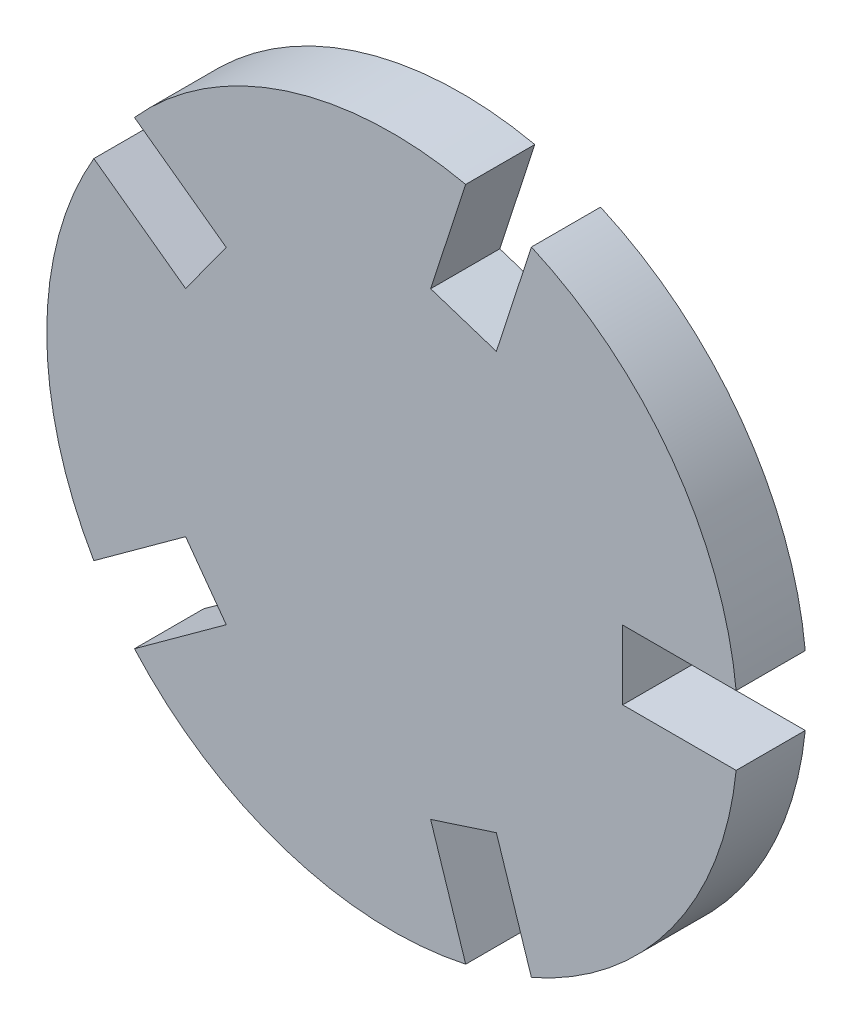
ISO-10303-21;
HEADER;
FILE_DESCRIPTION(('STEP AP214'),'2;1');
FILE_NAME('part.step','',(''),(''),'','','');
FILE_SCHEMA(('AUTOMOTIVE_DESIGN { 1 0 10303 214 1 1 1 1 }'));
ENDSEC;
DATA;
#1=APPLICATION_CONTEXT('core data for automotive mechanical design processes');
#2=APPLICATION_PROTOCOL_DEFINITION('international standard','automotive_design',2000,#1);
#3=PRODUCT_CONTEXT('',#1,'mechanical');
#4=PRODUCT('Part','Part','',(#3));
#5=PRODUCT_RELATED_PRODUCT_CATEGORY('part','',(#4));
#6=PRODUCT_DEFINITION_FORMATION('','',#4);
#7=PRODUCT_DEFINITION_CONTEXT('part definition',#1,'design');
#8=PRODUCT_DEFINITION('design','',#6,#7);
#9=PRODUCT_DEFINITION_SHAPE('','',#8);
#10=(LENGTH_UNIT() NAMED_UNIT(*) SI_UNIT(.MILLI.,.METRE.));
#11=(NAMED_UNIT(*) PLANE_ANGLE_UNIT() SI_UNIT($,.RADIAN.));
#12=(NAMED_UNIT(*) SI_UNIT($,.STERADIAN.) SOLID_ANGLE_UNIT());
#13=UNCERTAINTY_MEASURE_WITH_UNIT(LENGTH_MEASURE(1.E-05),#10,'distance_accuracy_value','');
#14=(GEOMETRIC_REPRESENTATION_CONTEXT(3) GLOBAL_UNCERTAINTY_ASSIGNED_CONTEXT((#13)) GLOBAL_UNIT_ASSIGNED_CONTEXT((#10,
#11,#12)) REPRESENTATION_CONTEXT('',''));
#15=CARTESIAN_POINT('',(0.,0.,0.));
#16=DIRECTION('',(0.,0.,1.));
#17=DIRECTION('',(1.,0.,0.));
#18=AXIS2_PLACEMENT_3D('',#15,#16,#17);
#19=CARTESIAN_POINT('',(0.,1.5,3.));
#20=DIRECTION('',(0.,1.,0.));
#21=DIRECTION('',(0.,0.,1.));
#22=AXIS2_PLACEMENT_3D('',#19,#20,#21);
#23=PLANE('',#22);
#24=DIRECTION('',(1.,0.,0.));
#25=VECTOR('',#24,1.);
#26=CARTESIAN_POINT('',(0.,1.5,0.));
#27=LINE('',#26,#25);
#28=CARTESIAN_POINT('',(10.,1.5,0.));
#29=VERTEX_POINT('',#28);
#30=CARTESIAN_POINT('',(14.9248115565993,1.5,0.));
#31=VERTEX_POINT('',#30);
#32=EDGE_CURVE('E208',#29,#31,#27,.T.);
#33=ORIENTED_EDGE('',*,*,#32,.T.);
#34=DIRECTION('',(0.,0.,-1.));
#35=VECTOR('',#34,1.);
#36=CARTESIAN_POINT('',(14.9248115565993,1.5,3.));
#37=LINE('',#36,#35);
#38=CARTESIAN_POINT('',(14.9248115565993,1.5,3.));
#39=VERTEX_POINT('',#38);
#40=EDGE_CURVE('E11',#39,#31,#37,.T.);
#41=ORIENTED_EDGE('',*,*,#40,.F.);
#42=DIRECTION('',(1.,0.,0.));
#43=VECTOR('',#42,1.);
#44=CARTESIAN_POINT('',(0.,1.5,3.));
#45=LINE('',#44,#43);
#46=CARTESIAN_POINT('',(10.,1.5,3.));
#47=VERTEX_POINT('',#46);
#48=EDGE_CURVE('E248',#47,#39,#45,.T.);
#49=ORIENTED_EDGE('',*,*,#48,.F.);
#50=DIRECTION('',(0.,0.,-1.));
#51=VECTOR('',#50,1.);
#52=CARTESIAN_POINT('',(10.,1.5,3.));
#53=LINE('',#52,#51);
#54=EDGE_CURVE('E203',#47,#29,#53,.T.);
#55=ORIENTED_EDGE('',*,*,#54,.T.);
#56=EDGE_LOOP('',(#33,#41,#49,#55));
#57=FACE_BOUND('',#56,.T.);
#58=ADVANCED_FACE('F39',(#57),#23,.F.);
#59=CARTESIAN_POINT('',(0.,0.,3.));
#60=DIRECTION('',(0.,0.,-1.));
#61=DIRECTION('',(-1.,0.,0.));
#62=AXIS2_PLACEMENT_3D('',#59,#60,#61);
#63=CYLINDRICAL_SURFACE('',#62,15.);
#64=CARTESIAN_POINT('',(0.,0.,0.));
#65=DIRECTION('',(0.,0.,1.));
#66=DIRECTION('',(1.,0.,0.));
#67=AXIS2_PLACEMENT_3D('',#64,#65,#66);
#68=CIRCLE('',#67,15.);
#69=CARTESIAN_POINT('',(6.03860518327568,13.7308137938185,0.));
#70=VERTEX_POINT('',#69);
#71=EDGE_CURVE('E211',#31,#70,#68,.T.);
#72=ORIENTED_EDGE('',*,*,#71,.T.);
#73=DIRECTION('',(0.,0.,-1.));
#74=VECTOR('',#73,1.);
#75=CARTESIAN_POINT('',(6.03860518327568,13.7308137938185,3.));
#76=LINE('',#75,#74);
#77=CARTESIAN_POINT('',(6.03860518327568,13.7308137938185,3.));
#78=VERTEX_POINT('',#77);
#79=EDGE_CURVE('E47',#78,#70,#76,.T.);
#80=ORIENTED_EDGE('',*,*,#79,.F.);
#81=CARTESIAN_POINT('',(0.,0.,3.));
#82=DIRECTION('',(0.,0.,1.));
#83=DIRECTION('',(1.,0.,0.));
#84=AXIS2_PLACEMENT_3D('',#81,#82,#83);
#85=CIRCLE('',#84,15.);
#86=EDGE_CURVE('E130',#39,#78,#85,.T.);
#87=ORIENTED_EDGE('',*,*,#86,.F.);
#88=ORIENTED_EDGE('',*,*,#40,.T.);
#89=EDGE_LOOP('',(#72,#80,#87,#88));
#90=FACE_BOUND('',#89,.T.);
#91=ADVANCED_FACE('F292',(#90),#63,.T.);
#92=CARTESIAN_POINT('',(1.42658477444273,-0.463525491562438,3.));
#93=DIRECTION('',(-0.95105651629515,0.309016994374958,0.));
#94=DIRECTION('',(-0.309016994374958,-0.95105651629515,0.));
#95=AXIS2_PLACEMENT_3D('',#92,#93,#94);
#96=PLANE('',#95);
#97=DIRECTION('',(0.309016994374958,0.95105651629515,0.));
#98=VECTOR('',#97,1.);
#99=CARTESIAN_POINT('',(1.42658477444273,-0.463525491562438,0.));
#100=LINE('',#99,#98);
#101=CARTESIAN_POINT('',(4.51675471819231,9.04703967138906,0.));
#102=VERTEX_POINT('',#101);
#103=EDGE_CURVE('E214',#102,#70,#100,.T.);
#104=ORIENTED_EDGE('',*,*,#103,.F.);
#105=DIRECTION('',(0.,0.,-1.));
#106=VECTOR('',#105,1.);
#107=CARTESIAN_POINT('',(4.51675471819231,9.04703967138906,3.));
#108=LINE('',#107,#106);
#109=CARTESIAN_POINT('',(4.51675471819231,9.04703967138906,3.));
#110=VERTEX_POINT('',#109);
#111=EDGE_CURVE('E285',#110,#102,#108,.T.);
#112=ORIENTED_EDGE('',*,*,#111,.F.);
#113=DIRECTION('',(0.309016994374958,0.95105651629515,0.));
#114=VECTOR('',#113,1.);
#115=CARTESIAN_POINT('',(1.42658477444273,-0.463525491562438,3.));
#116=LINE('',#115,#114);
#117=EDGE_CURVE('E291',#110,#78,#116,.T.);
#118=ORIENTED_EDGE('',*,*,#117,.T.);
#119=ORIENTED_EDGE('',*,*,#79,.T.);
#120=EDGE_LOOP('',(#104,#112,#118,#119));
#121=FACE_BOUND('',#120,.T.);
#122=ADVANCED_FACE('F289',(#121),#96,.T.);
#123=CARTESIAN_POINT('',(3.09016994374959,9.5105651629515,3.));
#124=DIRECTION('',(-0.309016994374958,-0.95105651629515,0.));
#125=DIRECTION('',(0.95105651629515,-0.309016994374958,0.));
#126=AXIS2_PLACEMENT_3D('',#123,#124,#125);
#127=PLANE('',#126);
#128=DIRECTION('',(-0.95105651629515,0.309016994374958,0.));
#129=VECTOR('',#128,1.);
#130=CARTESIAN_POINT('',(3.09016994374959,9.5105651629515,0.));
#131=LINE('',#130,#129);
#132=CARTESIAN_POINT('',(1.66358516930686,9.97409065451394,0.));
#133=VERTEX_POINT('',#132);
#134=EDGE_CURVE('E218',#102,#133,#131,.T.);
#135=ORIENTED_EDGE('',*,*,#134,.T.);
#136=DIRECTION('',(0.,0.,-1.));
#137=VECTOR('',#136,1.);
#138=CARTESIAN_POINT('',(1.66358516930686,9.97409065451394,3.));
#139=LINE('',#138,#137);
#140=CARTESIAN_POINT('',(1.66358516930686,9.97409065451394,3.));
#141=VERTEX_POINT('',#140);
#142=EDGE_CURVE('E282',#141,#133,#139,.T.);
#143=ORIENTED_EDGE('',*,*,#142,.F.);
#144=DIRECTION('',(-0.95105651629515,0.309016994374958,0.));
#145=VECTOR('',#144,1.);
#146=CARTESIAN_POINT('',(3.09016994374959,9.5105651629515,3.));
#147=LINE('',#146,#145);
#148=EDGE_CURVE('E311',#110,#141,#147,.T.);
#149=ORIENTED_EDGE('',*,*,#148,.F.);
#150=ORIENTED_EDGE('',*,*,#111,.T.);
#151=EDGE_LOOP('',(#135,#143,#149,#150));
#152=FACE_BOUND('',#151,.T.);
#153=ADVANCED_FACE('F302',(#152),#127,.F.);
#154=CARTESIAN_POINT('',(-1.42658477444272,0.463525491562437,3.));
#155=DIRECTION('',(-0.95105651629515,0.309016994374958,0.));
#156=DIRECTION('',(-0.309016994374958,-0.95105651629515,0.));
#157=AXIS2_PLACEMENT_3D('',#154,#155,#156);
#158=PLANE('',#157);
#159=DIRECTION('',(0.309016994374958,0.95105651629515,0.));
#160=VECTOR('',#159,1.);
#161=CARTESIAN_POINT('',(-1.42658477444272,0.463525491562437,0.));
#162=LINE('',#161,#160);
#163=CARTESIAN_POINT('',(3.18543563439023,14.6578647769434,0.));
#164=VERTEX_POINT('',#163);
#165=EDGE_CURVE('E220',#133,#164,#162,.T.);
#166=ORIENTED_EDGE('',*,*,#165,.T.);
#167=DIRECTION('',(0.,0.,-1.));
#168=VECTOR('',#167,1.);
#169=CARTESIAN_POINT('',(3.18543563439023,14.6578647769434,3.));
#170=LINE('',#169,#168);
#171=CARTESIAN_POINT('',(3.18543563439023,14.6578647769434,3.));
#172=VERTEX_POINT('',#171);
#173=EDGE_CURVE('E279',#172,#164,#170,.T.);
#174=ORIENTED_EDGE('',*,*,#173,.F.);
#175=DIRECTION('',(0.309016994374958,0.95105651629515,0.));
#176=VECTOR('',#175,1.);
#177=CARTESIAN_POINT('',(-1.42658477444272,0.463525491562437,3.));
#178=LINE('',#177,#176);
#179=EDGE_CURVE('E308',#141,#172,#178,.T.);
#180=ORIENTED_EDGE('',*,*,#179,.F.);
#181=ORIENTED_EDGE('',*,*,#142,.T.);
#182=EDGE_LOOP('',(#166,#174,#180,#181));
#183=FACE_BOUND('',#182,.T.);
#184=ADVANCED_FACE('F306',(#183),#158,.F.);
#185=CARTESIAN_POINT('',(-11.1927483086936,9.98610961777586,0.));
#186=VERTEX_POINT('',#185);
#187=EDGE_CURVE('E215',#164,#186,#68,.T.);
#188=ORIENTED_EDGE('',*,*,#187,.T.);
#189=DIRECTION('',(0.,0.,-1.));
#190=VECTOR('',#189,1.);
#191=CARTESIAN_POINT('',(-11.1927483086936,9.98610961777586,3.));
#192=LINE('',#191,#190);
#193=CARTESIAN_POINT('',(-11.1927483086936,9.98610961777586,3.));
#194=VERTEX_POINT('',#193);
#195=EDGE_CURVE('E277',#194,#186,#192,.T.);
#196=ORIENTED_EDGE('',*,*,#195,.F.);
#197=EDGE_CURVE('E310',#172,#194,#85,.T.);
#198=ORIENTED_EDGE('',*,*,#197,.F.);
#199=ORIENTED_EDGE('',*,*,#173,.T.);
#200=EDGE_LOOP('',(#188,#196,#198,#199));
#201=FACE_BOUND('',#200,.T.);
#202=ADVANCED_FACE('F354',(#201),#63,.T.);
#203=CARTESIAN_POINT('',(0.88167787843872,1.21352549156241,3.));
#204=DIRECTION('',(-0.58778525229248,-0.809016994374942,0.));
#205=DIRECTION('',(0.809016994374942,-0.58778525229248,0.));
#206=AXIS2_PLACEMENT_3D('',#203,#204,#205);
#207=PLANE('',#206);
#208=DIRECTION('',(-0.809016994374942,0.58778525229248,0.));
#209=VECTOR('',#208,1.);
#210=CARTESIAN_POINT('',(0.88167787843872,1.21352549156241,0.));
#211=LINE('',#210,#209);
#212=CARTESIAN_POINT('',(-7.2084920653107,7.09137801448722,0.));
#213=VERTEX_POINT('',#212);
#214=EDGE_CURVE('E222',#213,#186,#211,.T.);
#215=ORIENTED_EDGE('',*,*,#214,.F.);
#216=DIRECTION('',(0.,0.,-1.));
#217=VECTOR('',#216,1.);
#218=CARTESIAN_POINT('',(-7.2084920653107,7.09137801448722,3.));
#219=LINE('',#218,#217);
#220=CARTESIAN_POINT('',(-7.2084920653107,7.09137801448722,3.));
#221=VERTEX_POINT('',#220);
#222=EDGE_CURVE('E275',#221,#213,#219,.T.);
#223=ORIENTED_EDGE('',*,*,#222,.F.);
#224=DIRECTION('',(-0.809016994374942,0.58778525229248,0.));
#225=VECTOR('',#224,1.);
#226=CARTESIAN_POINT('',(0.88167787843872,1.21352549156241,3.));
#227=LINE('',#226,#225);
#228=EDGE_CURVE('E313',#221,#194,#227,.T.);
#229=ORIENTED_EDGE('',*,*,#228,.T.);
#230=ORIENTED_EDGE('',*,*,#195,.T.);
#231=EDGE_LOOP('',(#215,#223,#229,#230));
#232=FACE_BOUND('',#231,.T.);
#233=ADVANCED_FACE('F359',(#232),#207,.T.);
#234=CARTESIAN_POINT('',(-8.09016994374942,5.8778525229248,3.));
#235=DIRECTION('',(0.809016994374942,-0.58778525229248,0.));
#236=DIRECTION('',(0.58778525229248,0.809016994374942,0.));
#237=AXIS2_PLACEMENT_3D('',#234,#235,#236);
#238=PLANE('',#237);
#239=DIRECTION('',(-0.58778525229248,-0.809016994374942,0.));
#240=VECTOR('',#239,1.);
#241=CARTESIAN_POINT('',(-8.09016994374942,5.8778525229248,0.));
#242=LINE('',#241,#240);
#243=CARTESIAN_POINT('',(-8.97184782218814,4.66432703136239,0.));
#244=VERTEX_POINT('',#243);
#245=EDGE_CURVE('E225',#213,#244,#242,.T.);
#246=ORIENTED_EDGE('',*,*,#245,.T.);
#247=DIRECTION('',(0.,0.,-1.));
#248=VECTOR('',#247,1.);
#249=CARTESIAN_POINT('',(-8.97184782218814,4.66432703136239,3.));
#250=LINE('',#249,#248);
#251=CARTESIAN_POINT('',(-8.97184782218814,4.66432703136239,3.));
#252=VERTEX_POINT('',#251);
#253=EDGE_CURVE('E272',#252,#244,#250,.T.);
#254=ORIENTED_EDGE('',*,*,#253,.F.);
#255=DIRECTION('',(-0.58778525229248,-0.809016994374942,0.));
#256=VECTOR('',#255,1.);
#257=CARTESIAN_POINT('',(-8.09016994374942,5.8778525229248,3.));
#258=LINE('',#257,#256);
#259=EDGE_CURVE('E320',#221,#252,#258,.T.);
#260=ORIENTED_EDGE('',*,*,#259,.F.);
#261=ORIENTED_EDGE('',*,*,#222,.T.);
#262=EDGE_LOOP('',(#246,#254,#260,#261));
#263=FACE_BOUND('',#262,.T.);
#264=ADVANCED_FACE('F366',(#263),#238,.F.);
#265=CARTESIAN_POINT('',(-0.881677878438719,-1.21352549156241,3.));
#266=DIRECTION('',(-0.58778525229248,-0.809016994374942,0.));
#267=DIRECTION('',(0.809016994374942,-0.58778525229248,0.));
#268=AXIS2_PLACEMENT_3D('',#265,#266,#267);
#269=PLANE('',#268);
#270=DIRECTION('',(-0.809016994374942,0.58778525229248,0.));
#271=VECTOR('',#270,1.);
#272=CARTESIAN_POINT('',(-0.881677878438719,-1.21352549156241,0.));
#273=LINE('',#272,#271);
#274=CARTESIAN_POINT('',(-12.9561040655711,7.55905863465103,0.));
#275=VERTEX_POINT('',#274);
#276=EDGE_CURVE('E227',#244,#275,#273,.T.);
#277=ORIENTED_EDGE('',*,*,#276,.T.);
#278=DIRECTION('',(0.,0.,-1.));
#279=VECTOR('',#278,1.);
#280=CARTESIAN_POINT('',(-12.9561040655711,7.55905863465103,3.));
#281=LINE('',#280,#279);
#282=CARTESIAN_POINT('',(-12.9561040655711,7.55905863465103,3.));
#283=VERTEX_POINT('',#282);
#284=EDGE_CURVE('E269',#283,#275,#281,.T.);
#285=ORIENTED_EDGE('',*,*,#284,.F.);
#286=DIRECTION('',(-0.809016994374942,0.58778525229248,0.));
#287=VECTOR('',#286,1.);
#288=CARTESIAN_POINT('',(-0.881677878438719,-1.21352549156241,3.));
#289=LINE('',#288,#287);
#290=EDGE_CURVE('E322',#252,#283,#289,.T.);
#291=ORIENTED_EDGE('',*,*,#290,.F.);
#292=ORIENTED_EDGE('',*,*,#253,.T.);
#293=EDGE_LOOP('',(#277,#285,#291,#292));
#294=FACE_BOUND('',#293,.T.);
#295=ADVANCED_FACE('F368',(#294),#269,.F.);
#296=CARTESIAN_POINT('',(-12.9561040655712,-7.55905863465084,0.));
#297=VERTEX_POINT('',#296);
#298=EDGE_CURVE('E229',#275,#297,#68,.T.);
#299=ORIENTED_EDGE('',*,*,#298,.T.);
#300=DIRECTION('',(0.,0.,-1.));
#301=VECTOR('',#300,1.);
#302=CARTESIAN_POINT('',(-12.9561040655712,-7.55905863465084,3.));
#303=LINE('',#302,#301);
#304=CARTESIAN_POINT('',(-12.9561040655712,-7.55905863465084,3.));
#305=VERTEX_POINT('',#304);
#306=EDGE_CURVE('E267',#305,#297,#303,.T.);
#307=ORIENTED_EDGE('',*,*,#306,.F.);
#308=EDGE_CURVE('E314',#283,#305,#85,.T.);
#309=ORIENTED_EDGE('',*,*,#308,.F.);
#310=ORIENTED_EDGE('',*,*,#284,.T.);
#311=EDGE_LOOP('',(#299,#307,#309,#310));
#312=FACE_BOUND('',#311,.T.);
#313=ADVANCED_FACE('F370',(#312),#63,.T.);
#314=CARTESIAN_POINT('',(-0.881677878438703,1.21352549156243,3.));
#315=DIRECTION('',(0.587785252292468,-0.809016994374951,0.));
#316=DIRECTION('',(0.809016994374951,0.587785252292468,0.));
#317=AXIS2_PLACEMENT_3D('',#314,#315,#316);
#318=PLANE('',#317);
#319=DIRECTION('',(-0.809016994374951,-0.587785252292468,0.));
#320=VECTOR('',#319,1.);
#321=CARTESIAN_POINT('',(-0.881677878438703,1.21352549156243,0.));
#322=LINE('',#321,#320);
#323=CARTESIAN_POINT('',(-8.97184782218821,-4.66432703136226,0.));
#324=VERTEX_POINT('',#323);
#325=EDGE_CURVE('E230',#324,#297,#322,.T.);
#326=ORIENTED_EDGE('',*,*,#325,.F.);
#327=DIRECTION('',(0.,0.,-1.));
#328=VECTOR('',#327,1.);
#329=CARTESIAN_POINT('',(-8.97184782218821,-4.66432703136226,3.));
#330=LINE('',#329,#328);
#331=CARTESIAN_POINT('',(-8.97184782218821,-4.66432703136226,3.));
#332=VERTEX_POINT('',#331);
#333=EDGE_CURVE('E265',#332,#324,#330,.T.);
#334=ORIENTED_EDGE('',*,*,#333,.F.);
#335=DIRECTION('',(-0.809016994374951,-0.587785252292468,0.));
#336=VECTOR('',#335,1.);
#337=CARTESIAN_POINT('',(-0.881677878438703,1.21352549156243,3.));
#338=LINE('',#337,#336);
#339=EDGE_CURVE('E324',#332,#305,#338,.T.);
#340=ORIENTED_EDGE('',*,*,#339,.T.);
#341=ORIENTED_EDGE('',*,*,#306,.T.);
#342=EDGE_LOOP('',(#326,#334,#340,#341));
#343=FACE_BOUND('',#342,.T.);
#344=ADVANCED_FACE('F390',(#343),#318,.T.);
#345=CARTESIAN_POINT('',(-8.09016994374951,-5.87785252292469,3.));
#346=DIRECTION('',(0.809016994374951,0.587785252292468,0.));
#347=DIRECTION('',(-0.587785252292469,0.809016994374951,0.));
#348=AXIS2_PLACEMENT_3D('',#345,#346,#347);
#349=PLANE('',#348);
#350=DIRECTION('',(0.587785252292469,-0.809016994374951,0.));
#351=VECTOR('',#350,1.);
#352=CARTESIAN_POINT('',(-8.09016994374951,-5.87785252292469,0.));
#353=LINE('',#352,#351);
#354=CARTESIAN_POINT('',(-7.2084920653108,-7.09137801448711,0.));
#355=VERTEX_POINT('',#354);
#356=EDGE_CURVE('E233',#324,#355,#353,.T.);
#357=ORIENTED_EDGE('',*,*,#356,.T.);
#358=DIRECTION('',(0.,0.,-1.));
#359=VECTOR('',#358,1.);
#360=CARTESIAN_POINT('',(-7.2084920653108,-7.09137801448711,3.));
#361=LINE('',#360,#359);
#362=CARTESIAN_POINT('',(-7.2084920653108,-7.09137801448711,3.));
#363=VERTEX_POINT('',#362);
#364=EDGE_CURVE('E262',#363,#355,#361,.T.);
#365=ORIENTED_EDGE('',*,*,#364,.F.);
#366=DIRECTION('',(0.587785252292469,-0.809016994374951,0.));
#367=VECTOR('',#366,1.);
#368=CARTESIAN_POINT('',(-8.09016994374951,-5.87785252292469,3.));
#369=LINE('',#368,#367);
#370=EDGE_CURVE('E327',#332,#363,#369,.T.);
#371=ORIENTED_EDGE('',*,*,#370,.F.);
#372=ORIENTED_EDGE('',*,*,#333,.T.);
#373=EDGE_LOOP('',(#357,#365,#371,#372));
#374=FACE_BOUND('',#373,.T.);
#375=ADVANCED_FACE('F388',(#374),#349,.F.);
#376=CARTESIAN_POINT('',(0.881677878438702,-1.21352549156242,3.));
#377=DIRECTION('',(0.587785252292468,-0.809016994374951,0.));
#378=DIRECTION('',(0.809016994374951,0.587785252292468,0.));
#379=AXIS2_PLACEMENT_3D('',#376,#377,#378);
#380=PLANE('',#379);
#381=DIRECTION('',(-0.809016994374951,-0.587785252292469,0.));
#382=VECTOR('',#381,1.);
#383=CARTESIAN_POINT('',(0.881677878438702,-1.21352549156242,0.));
#384=LINE('',#383,#382);
#385=CARTESIAN_POINT('',(-11.1927483086938,-9.98610961777569,0.));
#386=VERTEX_POINT('',#385);
#387=EDGE_CURVE('E235',#355,#386,#384,.T.);
#388=ORIENTED_EDGE('',*,*,#387,.T.);
#389=DIRECTION('',(0.,0.,-1.));
#390=VECTOR('',#389,1.);
#391=CARTESIAN_POINT('',(-11.1927483086938,-9.98610961777569,3.));
#392=LINE('',#391,#390);
#393=CARTESIAN_POINT('',(-11.1927483086938,-9.98610961777569,3.));
#394=VERTEX_POINT('',#393);
#395=EDGE_CURVE('E259',#394,#386,#392,.T.);
#396=ORIENTED_EDGE('',*,*,#395,.F.);
#397=DIRECTION('',(-0.809016994374951,-0.587785252292469,0.));
#398=VECTOR('',#397,1.);
#399=CARTESIAN_POINT('',(0.881677878438702,-1.21352549156242,3.));
#400=LINE('',#399,#398);
#401=EDGE_CURVE('E329',#363,#394,#400,.T.);
#402=ORIENTED_EDGE('',*,*,#401,.F.);
#403=ORIENTED_EDGE('',*,*,#364,.T.);
#404=EDGE_LOOP('',(#388,#396,#402,#403));
#405=FACE_BOUND('',#404,.T.);
#406=ADVANCED_FACE('F384',(#405),#380,.F.);
#407=CARTESIAN_POINT('',(3.18543563439002,-14.6578647769434,0.));
#408=VERTEX_POINT('',#407);
#409=EDGE_CURVE('E237',#386,#408,#68,.T.);
#410=ORIENTED_EDGE('',*,*,#409,.T.);
#411=DIRECTION('',(0.,0.,-1.));
#412=VECTOR('',#411,1.);
#413=CARTESIAN_POINT('',(3.18543563439002,-14.6578647769434,3.));
#414=LINE('',#413,#412);
#415=CARTESIAN_POINT('',(3.18543563439002,-14.6578647769434,3.));
#416=VERTEX_POINT('',#415);
#417=EDGE_CURVE('E257',#416,#408,#414,.T.);
#418=ORIENTED_EDGE('',*,*,#417,.F.);
#419=EDGE_CURVE('E190',#394,#416,#85,.T.);
#420=ORIENTED_EDGE('',*,*,#419,.F.);
#421=ORIENTED_EDGE('',*,*,#395,.T.);
#422=EDGE_LOOP('',(#410,#418,#420,#421));
#423=FACE_BOUND('',#422,.T.);
#424=ADVANCED_FACE('F376',(#423),#63,.T.);
#425=CARTESIAN_POINT('',(-1.42658477444273,-0.463525491562418,3.));
#426=DIRECTION('',(0.951056516295154,0.309016994374945,0.));
#427=DIRECTION('',(-0.309016994374945,0.951056516295155,0.));
#428=AXIS2_PLACEMENT_3D('',#425,#426,#427);
#429=PLANE('',#428);
#430=DIRECTION('',(0.309016994374945,-0.951056516295155,0.));
#431=VECTOR('',#430,1.);
#432=CARTESIAN_POINT('',(-1.42658477444273,-0.463525491562418,0.));
#433=LINE('',#432,#431);
#434=CARTESIAN_POINT('',(1.66358516930671,-9.97409065451396,0.));
#435=VERTEX_POINT('',#434);
#436=EDGE_CURVE('E238',#435,#408,#433,.T.);
#437=ORIENTED_EDGE('',*,*,#436,.F.);
#438=DIRECTION('',(0.,0.,-1.));
#439=VECTOR('',#438,1.);
#440=CARTESIAN_POINT('',(1.66358516930671,-9.97409065451396,3.));
#441=LINE('',#440,#439);
#442=CARTESIAN_POINT('',(1.66358516930671,-9.97409065451396,3.));
#443=VERTEX_POINT('',#442);
#444=EDGE_CURVE('E255',#443,#435,#441,.T.);
#445=ORIENTED_EDGE('',*,*,#444,.F.);
#446=DIRECTION('',(0.309016994374945,-0.951056516295155,0.));
#447=VECTOR('',#446,1.);
#448=CARTESIAN_POINT('',(-1.42658477444273,-0.463525491562418,3.));
#449=LINE('',#448,#447);
#450=EDGE_CURVE('E331',#443,#416,#449,.T.);
#451=ORIENTED_EDGE('',*,*,#450,.T.);
#452=ORIENTED_EDGE('',*,*,#417,.T.);
#453=EDGE_LOOP('',(#437,#445,#451,#452));
#454=FACE_BOUND('',#453,.T.);
#455=ADVANCED_FACE('F379',(#454),#429,.T.);
#456=CARTESIAN_POINT('',(3.09016994374945,-9.51056516295155,3.));
#457=DIRECTION('',(-0.309016994374945,0.951056516295154,0.));
#458=DIRECTION('',(-0.951056516295155,-0.309016994374945,0.));
#459=AXIS2_PLACEMENT_3D('',#456,#457,#458);
#460=PLANE('',#459);
#461=DIRECTION('',(0.951056516295155,0.309016994374945,0.));
#462=VECTOR('',#461,1.);
#463=CARTESIAN_POINT('',(3.09016994374945,-9.51056516295155,0.));
#464=LINE('',#463,#462);
#465=CARTESIAN_POINT('',(4.51675471819218,-9.04703967138913,0.));
#466=VERTEX_POINT('',#465);
#467=EDGE_CURVE('E241',#435,#466,#464,.T.);
#468=ORIENTED_EDGE('',*,*,#467,.T.);
#469=DIRECTION('',(0.,0.,-1.));
#470=VECTOR('',#469,1.);
#471=CARTESIAN_POINT('',(4.51675471819218,-9.04703967138913,3.));
#472=LINE('',#471,#470);
#473=CARTESIAN_POINT('',(4.51675471819218,-9.04703967138913,3.));
#474=VERTEX_POINT('',#473);
#475=EDGE_CURVE('E252',#474,#466,#472,.T.);
#476=ORIENTED_EDGE('',*,*,#475,.F.);
#477=DIRECTION('',(0.951056516295155,0.309016994374945,0.));
#478=VECTOR('',#477,1.);
#479=CARTESIAN_POINT('',(3.09016994374945,-9.51056516295155,3.));
#480=LINE('',#479,#478);
#481=EDGE_CURVE('E333',#443,#474,#480,.T.);
#482=ORIENTED_EDGE('',*,*,#481,.F.);
#483=ORIENTED_EDGE('',*,*,#444,.T.);
#484=EDGE_LOOP('',(#468,#476,#482,#483));
#485=FACE_BOUND('',#484,.T.);
#486=ADVANCED_FACE('F338',(#485),#460,.F.);
#487=CARTESIAN_POINT('',(1.42658477444273,0.463525491562416,3.));
#488=DIRECTION('',(0.951056516295154,0.309016994374945,0.));
#489=DIRECTION('',(-0.309016994374945,0.951056516295155,0.));
#490=AXIS2_PLACEMENT_3D('',#487,#488,#489);
#491=PLANE('',#490);
#492=DIRECTION('',(0.309016994374945,-0.951056516295154,0.));
#493=VECTOR('',#492,1.);
#494=CARTESIAN_POINT('',(1.42658477444273,0.463525491562416,0.));
#495=LINE('',#494,#493);
#496=CARTESIAN_POINT('',(6.03860518327549,-13.7308137938186,0.));
#497=VERTEX_POINT('',#496);
#498=EDGE_CURVE('E243',#466,#497,#495,.T.);
#499=ORIENTED_EDGE('',*,*,#498,.T.);
#500=DIRECTION('',(0.,0.,-1.));
#501=VECTOR('',#500,1.);
#502=CARTESIAN_POINT('',(6.03860518327549,-13.7308137938186,3.));
#503=LINE('',#502,#501);
#504=CARTESIAN_POINT('',(6.03860518327549,-13.7308137938186,3.));
#505=VERTEX_POINT('',#504);
#506=EDGE_CURVE('E199',#505,#497,#503,.T.);
#507=ORIENTED_EDGE('',*,*,#506,.F.);
#508=DIRECTION('',(0.309016994374945,-0.951056516295154,0.));
#509=VECTOR('',#508,1.);
#510=CARTESIAN_POINT('',(1.42658477444273,0.463525491562416,3.));
#511=LINE('',#510,#509);
#512=EDGE_CURVE('E185',#474,#505,#511,.T.);
#513=ORIENTED_EDGE('',*,*,#512,.F.);
#514=ORIENTED_EDGE('',*,*,#475,.T.);
#515=EDGE_LOOP('',(#499,#507,#513,#514));
#516=FACE_BOUND('',#515,.T.);
#517=ADVANCED_FACE('F342',(#516),#491,.F.);
#518=CARTESIAN_POINT('',(14.9248115565993,-1.5,0.));
#519=VERTEX_POINT('',#518);
#520=EDGE_CURVE('E195',#497,#519,#68,.T.);
#521=ORIENTED_EDGE('',*,*,#520,.T.);
#522=DIRECTION('',(0.,0.,-1.));
#523=VECTOR('',#522,1.);
#524=CARTESIAN_POINT('',(14.9248115565993,-1.5,3.));
#525=LINE('',#524,#523);
#526=CARTESIAN_POINT('',(14.9248115565993,-1.5,3.));
#527=VERTEX_POINT('',#526);
#528=EDGE_CURVE('E192',#527,#519,#525,.T.);
#529=ORIENTED_EDGE('',*,*,#528,.F.);
#530=EDGE_CURVE('E179',#505,#527,#85,.T.);
#531=ORIENTED_EDGE('',*,*,#530,.F.);
#532=ORIENTED_EDGE('',*,*,#506,.T.);
#533=EDGE_LOOP('',(#521,#529,#531,#532));
#534=FACE_BOUND('',#533,.T.);
#535=ADVANCED_FACE('F193',(#534),#63,.T.);
#536=CARTESIAN_POINT('',(0.,-1.5,3.));
#537=DIRECTION('',(0.,1.,0.));
#538=DIRECTION('',(0.,0.,1.));
#539=AXIS2_PLACEMENT_3D('',#536,#537,#538);
#540=PLANE('',#539);
#541=DIRECTION('',(1.,0.,0.));
#542=VECTOR('',#541,1.);
#543=CARTESIAN_POINT('',(0.,-1.5,0.));
#544=LINE('',#543,#542);
#545=CARTESIAN_POINT('',(10.,-1.5,0.));
#546=VERTEX_POINT('',#545);
#547=EDGE_CURVE('E245',#546,#519,#544,.T.);
#548=ORIENTED_EDGE('',*,*,#547,.F.);
#549=DIRECTION('',(0.,0.,-1.));
#550=VECTOR('',#549,1.);
#551=CARTESIAN_POINT('',(10.,-1.5,3.));
#552=LINE('',#551,#550);
#553=CARTESIAN_POINT('',(10.,-1.5,3.));
#554=VERTEX_POINT('',#553);
#555=EDGE_CURVE('E119',#554,#546,#552,.T.);
#556=ORIENTED_EDGE('',*,*,#555,.F.);
#557=DIRECTION('',(1.,0.,0.));
#558=VECTOR('',#557,1.);
#559=CARTESIAN_POINT('',(0.,-1.5,3.));
#560=LINE('',#559,#558);
#561=EDGE_CURVE('E183',#554,#527,#560,.T.);
#562=ORIENTED_EDGE('',*,*,#561,.T.);
#563=ORIENTED_EDGE('',*,*,#528,.T.);
#564=EDGE_LOOP('',(#548,#556,#562,#563));
#565=FACE_BOUND('',#564,.T.);
#566=ADVANCED_FACE('F201',(#565),#540,.T.);
#567=CARTESIAN_POINT('',(10.,0.,3.));
#568=DIRECTION('',(-1.,0.,0.));
#569=DIRECTION('',(0.,0.,1.));
#570=AXIS2_PLACEMENT_3D('',#567,#568,#569);
#571=PLANE('',#570);
#572=DIRECTION('',(0.,1.,0.));
#573=VECTOR('',#572,1.);
#574=CARTESIAN_POINT('',(10.,0.,0.));
#575=LINE('',#574,#573);
#576=EDGE_CURVE('E122',#546,#29,#575,.T.);
#577=ORIENTED_EDGE('',*,*,#576,.T.);
#578=ORIENTED_EDGE('',*,*,#54,.F.);
#579=DIRECTION('',(0.,1.,0.));
#580=VECTOR('',#579,1.);
#581=CARTESIAN_POINT('',(10.,0.,3.));
#582=LINE('',#581,#580);
#583=EDGE_CURVE('E55',#554,#47,#582,.T.);
#584=ORIENTED_EDGE('',*,*,#583,.F.);
#585=ORIENTED_EDGE('',*,*,#555,.T.);
#586=EDGE_LOOP('',(#577,#578,#584,#585));
#587=FACE_BOUND('',#586,.T.);
#588=ADVANCED_FACE('F406',(#587),#571,.F.);
#589=CARTESIAN_POINT('',(0.,0.,3.));
#590=DIRECTION('',(0.,0.,1.));
#591=DIRECTION('',(1.,0.,0.));
#592=AXIS2_PLACEMENT_3D('',#589,#590,#591);
#593=PLANE('',#592);
#594=ORIENTED_EDGE('',*,*,#48,.T.);
#595=ORIENTED_EDGE('',*,*,#86,.T.);
#596=ORIENTED_EDGE('',*,*,#117,.F.);
#597=ORIENTED_EDGE('',*,*,#148,.T.);
#598=ORIENTED_EDGE('',*,*,#179,.T.);
#599=ORIENTED_EDGE('',*,*,#197,.T.);
#600=ORIENTED_EDGE('',*,*,#228,.F.);
#601=ORIENTED_EDGE('',*,*,#259,.T.);
#602=ORIENTED_EDGE('',*,*,#290,.T.);
#603=ORIENTED_EDGE('',*,*,#308,.T.);
#604=ORIENTED_EDGE('',*,*,#339,.F.);
#605=ORIENTED_EDGE('',*,*,#370,.T.);
#606=ORIENTED_EDGE('',*,*,#401,.T.);
#607=ORIENTED_EDGE('',*,*,#419,.T.);
#608=ORIENTED_EDGE('',*,*,#450,.F.);
#609=ORIENTED_EDGE('',*,*,#481,.T.);
#610=ORIENTED_EDGE('',*,*,#512,.T.);
#611=ORIENTED_EDGE('',*,*,#530,.T.);
#612=ORIENTED_EDGE('',*,*,#561,.F.);
#613=ORIENTED_EDGE('',*,*,#583,.T.);
#614=EDGE_LOOP('',(#594,#595,#596,#597,#598,#599,#600,#601,#602,#603,#604,#605,#606,#607,#608,
#609,#610,#611,#612,#613));
#615=FACE_BOUND('',#614,.T.);
#616=ADVANCED_FACE('F181',(#615),#593,.T.);
#617=CARTESIAN_POINT('',(0.,0.,0.));
#618=DIRECTION('',(0.,0.,1.));
#619=DIRECTION('',(1.,0.,0.));
#620=AXIS2_PLACEMENT_3D('',#617,#618,#619);
#621=PLANE('',#620);
#622=ORIENTED_EDGE('',*,*,#32,.F.);
#623=ORIENTED_EDGE('',*,*,#576,.F.);
#624=ORIENTED_EDGE('',*,*,#547,.T.);
#625=ORIENTED_EDGE('',*,*,#520,.F.);
#626=ORIENTED_EDGE('',*,*,#498,.F.);
#627=ORIENTED_EDGE('',*,*,#467,.F.);
#628=ORIENTED_EDGE('',*,*,#436,.T.);
#629=ORIENTED_EDGE('',*,*,#409,.F.);
#630=ORIENTED_EDGE('',*,*,#387,.F.);
#631=ORIENTED_EDGE('',*,*,#356,.F.);
#632=ORIENTED_EDGE('',*,*,#325,.T.);
#633=ORIENTED_EDGE('',*,*,#298,.F.);
#634=ORIENTED_EDGE('',*,*,#276,.F.);
#635=ORIENTED_EDGE('',*,*,#245,.F.);
#636=ORIENTED_EDGE('',*,*,#214,.T.);
#637=ORIENTED_EDGE('',*,*,#187,.F.);
#638=ORIENTED_EDGE('',*,*,#165,.F.);
#639=ORIENTED_EDGE('',*,*,#134,.F.);
#640=ORIENTED_EDGE('',*,*,#103,.T.);
#641=ORIENTED_EDGE('',*,*,#71,.F.);
#642=EDGE_LOOP('',(#622,#623,#624,#625,#626,#627,#628,#629,#630,#631,#632,#633,#634,#635,#636,
#637,#638,#639,#640,#641));
#643=FACE_BOUND('',#642,.T.);
#644=ADVANCED_FACE('F297',(#643),#621,.F.);
#645=CLOSED_SHELL('',(#58,#91,#122,#153,#184,#202,#233,#264,#295,#313,#344,#375,#406,#424,#455,
#486,#517,#535,#566,#588,#616,#644));
#646=MANIFOLD_SOLID_BREP('B2',#645);
#647=ADVANCED_BREP_SHAPE_REPRESENTATION('',(#18,#646),#14);
#648=SHAPE_DEFINITION_REPRESENTATION(#9,#647);
ENDSEC;
END-ISO-10303-21;
